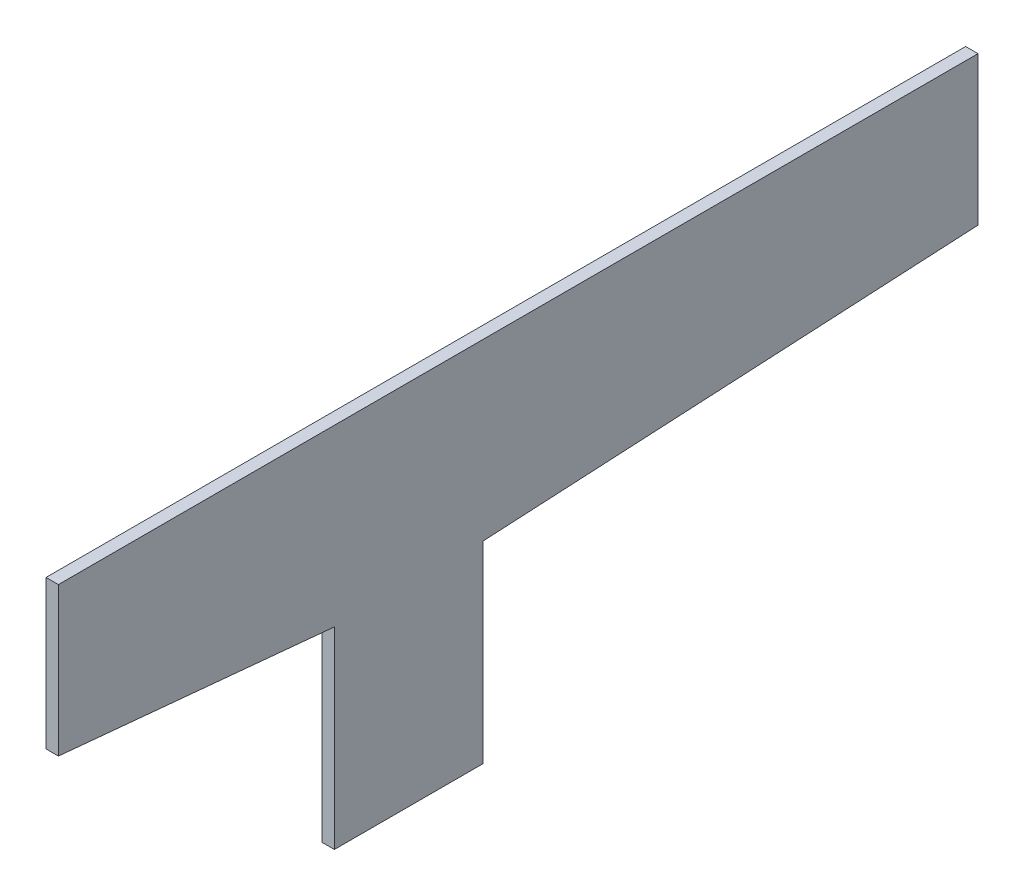
ISO-10303-21;
HEADER;
FILE_DESCRIPTION(('STEP AP214'),'2;1');
FILE_NAME('part.step','',(''),(''),'','','');
FILE_SCHEMA(('AUTOMOTIVE_DESIGN { 1 0 10303 214 1 1 1 1 }'));
ENDSEC;
DATA;
#1=APPLICATION_CONTEXT('core data for automotive mechanical design processes');
#2=APPLICATION_PROTOCOL_DEFINITION('international standard','automotive_design',2000,#1);
#3=PRODUCT_CONTEXT('',#1,'mechanical');
#4=PRODUCT('Part','Part','',(#3));
#5=PRODUCT_RELATED_PRODUCT_CATEGORY('part','',(#4));
#6=PRODUCT_DEFINITION_FORMATION('','',#4);
#7=PRODUCT_DEFINITION_CONTEXT('part definition',#1,'design');
#8=PRODUCT_DEFINITION('design','',#6,#7);
#9=PRODUCT_DEFINITION_SHAPE('','',#8);
#10=(LENGTH_UNIT() NAMED_UNIT(*) SI_UNIT(.MILLI.,.METRE.));
#11=(NAMED_UNIT(*) PLANE_ANGLE_UNIT() SI_UNIT($,.RADIAN.));
#12=(NAMED_UNIT(*) SI_UNIT($,.STERADIAN.) SOLID_ANGLE_UNIT());
#13=UNCERTAINTY_MEASURE_WITH_UNIT(LENGTH_MEASURE(1.E-05),#10,'distance_accuracy_value','');
#14=(GEOMETRIC_REPRESENTATION_CONTEXT(3) GLOBAL_UNCERTAINTY_ASSIGNED_CONTEXT((#13)) GLOBAL_UNIT_ASSIGNED_CONTEXT((#10,
#11,#12)) REPRESENTATION_CONTEXT('',''));
#15=CARTESIAN_POINT('',(0.,0.,0.));
#16=DIRECTION('',(0.,0.,1.));
#17=DIRECTION('',(1.,0.,0.));
#18=AXIS2_PLACEMENT_3D('',#15,#16,#17);
#19=CARTESIAN_POINT('',(1.5875,18.0500000008994,89.85));
#20=DIRECTION('',(0.,0.995552171318607,-0.0942118579734322));
#21=DIRECTION('',(0.,0.0942118579734322,0.995552171318608));
#22=AXIS2_PLACEMENT_3D('',#19,#20,#21);
#23=PLANE('',#22);
#24=DIRECTION('',(0.,-0.0942118579734322,-0.995552171318608));
#25=VECTOR('',#24,1.);
#26=CARTESIAN_POINT('',(-1.5875,18.0500000008994,89.85));
#27=LINE('',#26,#25);
#28=CARTESIAN_POINT('',(-1.5875,18.0500000008994,89.85));
#29=VERTEX_POINT('',#28);
#30=CARTESIAN_POINT('',(-1.5875,11.3500000042299,19.05));
#31=VERTEX_POINT('',#30);
#32=EDGE_CURVE('E129',#29,#31,#27,.T.);
#33=ORIENTED_EDGE('',*,*,#32,.T.);
#34=DIRECTION('',(-1.,0.,0.));
#35=VECTOR('',#34,1.);
#36=CARTESIAN_POINT('',(1.5875,11.3500000042299,19.05));
#37=LINE('',#36,#35);
#38=CARTESIAN_POINT('',(1.5875,11.3500000042299,19.05));
#39=VERTEX_POINT('',#38);
#40=EDGE_CURVE('E11',#39,#31,#37,.T.);
#41=ORIENTED_EDGE('',*,*,#40,.F.);
#42=DIRECTION('',(0.,-0.0942118579734322,-0.995552171318608));
#43=VECTOR('',#42,1.);
#44=CARTESIAN_POINT('',(1.5875,18.0500000008994,89.85));
#45=LINE('',#44,#43);
#46=CARTESIAN_POINT('',(1.5875,18.0500000008994,89.85));
#47=VERTEX_POINT('',#46);
#48=EDGE_CURVE('E143',#47,#39,#45,.T.);
#49=ORIENTED_EDGE('',*,*,#48,.F.);
#50=DIRECTION('',(-1.,0.,0.));
#51=VECTOR('',#50,1.);
#52=CARTESIAN_POINT('',(1.5875,18.0500000008994,89.85));
#53=LINE('',#52,#51);
#54=EDGE_CURVE('E125',#47,#29,#53,.T.);
#55=ORIENTED_EDGE('',*,*,#54,.T.);
#56=EDGE_LOOP('',(#33,#41,#49,#55));
#57=FACE_BOUND('',#56,.T.);
#58=ADVANCED_FACE('F33',(#57),#23,.F.);
#59=CARTESIAN_POINT('',(1.5875,11.3500000042299,19.05));
#60=DIRECTION('',(0.,0.,-1.));
#61=DIRECTION('',(-1.,0.,0.));
#62=AXIS2_PLACEMENT_3D('',#59,#60,#61);
#63=PLANE('',#62);
#64=DIRECTION('',(0.,-1.,0.));
#65=VECTOR('',#64,1.);
#66=CARTESIAN_POINT('',(-1.5875,11.3500000042299,19.05));
#67=LINE('',#66,#65);
#68=CARTESIAN_POINT('',(-1.5875,-38.1,19.05));
#69=VERTEX_POINT('',#68);
#70=EDGE_CURVE('E132',#31,#69,#67,.T.);
#71=ORIENTED_EDGE('',*,*,#70,.T.);
#72=DIRECTION('',(-1.,0.,0.));
#73=VECTOR('',#72,1.);
#74=CARTESIAN_POINT('',(1.5875,-38.1,19.05));
#75=LINE('',#74,#73);
#76=CARTESIAN_POINT('',(1.5875,-38.1,19.05));
#77=VERTEX_POINT('',#76);
#78=EDGE_CURVE('E41',#77,#69,#75,.T.);
#79=ORIENTED_EDGE('',*,*,#78,.F.);
#80=DIRECTION('',(0.,-1.,0.));
#81=VECTOR('',#80,1.);
#82=CARTESIAN_POINT('',(1.5875,11.3500000042299,19.05));
#83=LINE('',#82,#81);
#84=EDGE_CURVE('E92',#39,#77,#83,.T.);
#85=ORIENTED_EDGE('',*,*,#84,.F.);
#86=ORIENTED_EDGE('',*,*,#40,.T.);
#87=EDGE_LOOP('',(#71,#79,#85,#86));
#88=FACE_BOUND('',#87,.T.);
#89=ADVANCED_FACE('F178',(#88),#63,.F.);
#90=CARTESIAN_POINT('',(1.5875,-38.1,19.05));
#91=DIRECTION('',(0.,1.,0.));
#92=DIRECTION('',(0.,0.,1.));
#93=AXIS2_PLACEMENT_3D('',#90,#91,#92);
#94=PLANE('',#93);
#95=DIRECTION('',(0.,0.,-1.));
#96=VECTOR('',#95,1.);
#97=CARTESIAN_POINT('',(-1.5875,-38.1,19.05));
#98=LINE('',#97,#96);
#99=CARTESIAN_POINT('',(-1.5875,-38.1,-19.05));
#100=VERTEX_POINT('',#99);
#101=EDGE_CURVE('E134',#69,#100,#98,.T.);
#102=ORIENTED_EDGE('',*,*,#101,.T.);
#103=DIRECTION('',(-1.,0.,0.));
#104=VECTOR('',#103,1.);
#105=CARTESIAN_POINT('',(1.5875,-38.1,-19.05));
#106=LINE('',#105,#104);
#107=CARTESIAN_POINT('',(1.5875,-38.1,-19.05));
#108=VERTEX_POINT('',#107);
#109=EDGE_CURVE('E150',#108,#100,#106,.T.);
#110=ORIENTED_EDGE('',*,*,#109,.F.);
#111=DIRECTION('',(0.,0.,-1.));
#112=VECTOR('',#111,1.);
#113=CARTESIAN_POINT('',(1.5875,-38.1,19.05));
#114=LINE('',#113,#112);
#115=EDGE_CURVE('E158',#77,#108,#114,.T.);
#116=ORIENTED_EDGE('',*,*,#115,.F.);
#117=ORIENTED_EDGE('',*,*,#78,.T.);
#118=EDGE_LOOP('',(#102,#110,#116,#117));
#119=FACE_BOUND('',#118,.T.);
#120=ADVANCED_FACE('F156',(#119),#94,.F.);
#121=CARTESIAN_POINT('',(1.5875,-38.1,-19.05));
#122=DIRECTION('',(0.,0.,1.));
#123=DIRECTION('',(1.,0.,0.));
#124=AXIS2_PLACEMENT_3D('',#121,#122,#123);
#125=PLANE('',#124);
#126=DIRECTION('',(0.,1.,0.));
#127=VECTOR('',#126,1.);
#128=CARTESIAN_POINT('',(-1.5875,-38.1,-19.05));
#129=LINE('',#128,#127);
#130=CARTESIAN_POINT('',(-1.5875,11.3500000042299,-19.05));
#131=VERTEX_POINT('',#130);
#132=EDGE_CURVE('E136',#100,#131,#129,.T.);
#133=ORIENTED_EDGE('',*,*,#132,.T.);
#134=DIRECTION('',(-1.,0.,0.));
#135=VECTOR('',#134,1.);
#136=CARTESIAN_POINT('',(1.5875,11.3500000042299,-19.05));
#137=LINE('',#136,#135);
#138=CARTESIAN_POINT('',(1.5875,11.3500000042299,-19.05));
#139=VERTEX_POINT('',#138);
#140=EDGE_CURVE('E147',#139,#131,#137,.T.);
#141=ORIENTED_EDGE('',*,*,#140,.F.);
#142=DIRECTION('',(0.,1.,0.));
#143=VECTOR('',#142,1.);
#144=CARTESIAN_POINT('',(1.5875,-38.1,-19.05));
#145=LINE('',#144,#143);
#146=EDGE_CURVE('E170',#108,#139,#145,.T.);
#147=ORIENTED_EDGE('',*,*,#146,.F.);
#148=ORIENTED_EDGE('',*,*,#109,.T.);
#149=EDGE_LOOP('',(#133,#141,#147,#148));
#150=FACE_BOUND('',#149,.T.);
#151=ADVANCED_FACE('F166',(#150),#125,.F.);
#152=CARTESIAN_POINT('',(1.5875,11.3500000042299,-19.05));
#153=DIRECTION('',(0.,0.998611305293115,0.0526826436388818));
#154=DIRECTION('',(0.,-0.0526826436388818,0.998611305293115));
#155=AXIS2_PLACEMENT_3D('',#152,#153,#154);
#156=PLANE('',#155);
#157=DIRECTION('',(0.,0.0526826436388818,-0.998611305293115));
#158=VECTOR('',#157,1.);
#159=CARTESIAN_POINT('',(-1.5875,11.3500000042299,-19.05));
#160=LINE('',#159,#158);
#161=CARTESIAN_POINT('',(-1.5875,18.0500000008994,-146.05));
#162=VERTEX_POINT('',#161);
#163=EDGE_CURVE('E138',#131,#162,#160,.T.);
#164=ORIENTED_EDGE('',*,*,#163,.T.);
#165=DIRECTION('',(-1.,0.,0.));
#166=VECTOR('',#165,1.);
#167=CARTESIAN_POINT('',(1.5875,18.0500000008994,-146.05));
#168=LINE('',#167,#166);
#169=CARTESIAN_POINT('',(1.5875,18.0500000008994,-146.05));
#170=VERTEX_POINT('',#169);
#171=EDGE_CURVE('E120',#170,#162,#168,.T.);
#172=ORIENTED_EDGE('',*,*,#171,.F.);
#173=DIRECTION('',(0.,0.0526826436388818,-0.998611305293115));
#174=VECTOR('',#173,1.);
#175=CARTESIAN_POINT('',(1.5875,11.3500000042299,-19.05));
#176=LINE('',#175,#174);
#177=EDGE_CURVE('E111',#139,#170,#176,.T.);
#178=ORIENTED_EDGE('',*,*,#177,.F.);
#179=ORIENTED_EDGE('',*,*,#140,.T.);
#180=EDGE_LOOP('',(#164,#172,#178,#179));
#181=FACE_BOUND('',#180,.T.);
#182=ADVANCED_FACE('F169',(#181),#156,.F.);
#183=CARTESIAN_POINT('',(1.5875,18.0500000008994,-146.05));
#184=DIRECTION('',(0.,0.,1.));
#185=DIRECTION('',(1.,0.,0.));
#186=AXIS2_PLACEMENT_3D('',#183,#184,#185);
#187=PLANE('',#186);
#188=DIRECTION('',(0.,1.,0.));
#189=VECTOR('',#188,1.);
#190=CARTESIAN_POINT('',(-1.5875,18.0500000008994,-146.05));
#191=LINE('',#190,#189);
#192=CARTESIAN_POINT('',(-1.5875,56.1500000008994,-146.05));
#193=VERTEX_POINT('',#192);
#194=EDGE_CURVE('E119',#162,#193,#191,.T.);
#195=ORIENTED_EDGE('',*,*,#194,.T.);
#196=DIRECTION('',(-1.,0.,0.));
#197=VECTOR('',#196,1.);
#198=CARTESIAN_POINT('',(1.5875,56.1500000008994,-146.05));
#199=LINE('',#198,#197);
#200=CARTESIAN_POINT('',(1.5875,56.1500000008994,-146.05));
#201=VERTEX_POINT('',#200);
#202=EDGE_CURVE('E116',#201,#193,#199,.T.);
#203=ORIENTED_EDGE('',*,*,#202,.F.);
#204=DIRECTION('',(0.,1.,0.));
#205=VECTOR('',#204,1.);
#206=CARTESIAN_POINT('',(1.5875,18.0500000008994,-146.05));
#207=LINE('',#206,#205);
#208=EDGE_CURVE('E105',#170,#201,#207,.T.);
#209=ORIENTED_EDGE('',*,*,#208,.F.);
#210=ORIENTED_EDGE('',*,*,#171,.T.);
#211=EDGE_LOOP('',(#195,#203,#209,#210));
#212=FACE_BOUND('',#211,.T.);
#213=ADVANCED_FACE('F117',(#212),#187,.F.);
#214=CARTESIAN_POINT('',(1.5875,56.1500000008994,-146.05));
#215=DIRECTION('',(0.,-1.,0.));
#216=DIRECTION('',(0.,0.,-1.));
#217=AXIS2_PLACEMENT_3D('',#214,#215,#216);
#218=PLANE('',#217);
#219=DIRECTION('',(0.,0.,1.));
#220=VECTOR('',#219,1.);
#221=CARTESIAN_POINT('',(-1.5875,56.1500000008994,-146.05));
#222=LINE('',#221,#220);
#223=CARTESIAN_POINT('',(-1.5875,56.1500000008994,89.85));
#224=VERTEX_POINT('',#223);
#225=EDGE_CURVE('E78',#193,#224,#222,.T.);
#226=ORIENTED_EDGE('',*,*,#225,.T.);
#227=DIRECTION('',(-1.,0.,0.));
#228=VECTOR('',#227,1.);
#229=CARTESIAN_POINT('',(1.5875,56.1500000008994,89.85));
#230=LINE('',#229,#228);
#231=CARTESIAN_POINT('',(1.5875,56.1500000008994,89.85));
#232=VERTEX_POINT('',#231);
#233=EDGE_CURVE('E121',#232,#224,#230,.T.);
#234=ORIENTED_EDGE('',*,*,#233,.F.);
#235=DIRECTION('',(0.,0.,1.));
#236=VECTOR('',#235,1.);
#237=CARTESIAN_POINT('',(1.5875,56.1500000008994,-146.05));
#238=LINE('',#237,#236);
#239=EDGE_CURVE('E109',#201,#232,#238,.T.);
#240=ORIENTED_EDGE('',*,*,#239,.F.);
#241=ORIENTED_EDGE('',*,*,#202,.T.);
#242=EDGE_LOOP('',(#226,#234,#240,#241));
#243=FACE_BOUND('',#242,.T.);
#244=ADVANCED_FACE('F123',(#243),#218,.F.);
#245=CARTESIAN_POINT('',(1.5875,56.1500000008994,89.85));
#246=DIRECTION('',(0.,0.,-1.));
#247=DIRECTION('',(0.,1.,0.));
#248=AXIS2_PLACEMENT_3D('',#245,#246,#247);
#249=PLANE('',#248);
#250=DIRECTION('',(0.,-1.,0.));
#251=VECTOR('',#250,1.);
#252=CARTESIAN_POINT('',(-1.5875,56.1500000008994,89.85));
#253=LINE('',#252,#251);
#254=EDGE_CURVE('E84',#224,#29,#253,.T.);
#255=ORIENTED_EDGE('',*,*,#254,.T.);
#256=ORIENTED_EDGE('',*,*,#54,.F.);
#257=DIRECTION('',(0.,-1.,0.));
#258=VECTOR('',#257,1.);
#259=CARTESIAN_POINT('',(1.5875,56.1500000008994,89.85));
#260=LINE('',#259,#258);
#261=EDGE_CURVE('E49',#232,#47,#260,.T.);
#262=ORIENTED_EDGE('',*,*,#261,.F.);
#263=ORIENTED_EDGE('',*,*,#233,.T.);
#264=EDGE_LOOP('',(#255,#256,#262,#263));
#265=FACE_BOUND('',#264,.T.);
#266=ADVANCED_FACE('F194',(#265),#249,.F.);
#267=CARTESIAN_POINT('',(1.5875,0.,0.));
#268=DIRECTION('',(-1.,0.,0.));
#269=DIRECTION('',(0.,0.,1.));
#270=AXIS2_PLACEMENT_3D('',#267,#268,#269);
#271=PLANE('',#270);
#272=ORIENTED_EDGE('',*,*,#48,.T.);
#273=ORIENTED_EDGE('',*,*,#84,.T.);
#274=ORIENTED_EDGE('',*,*,#115,.T.);
#275=ORIENTED_EDGE('',*,*,#146,.T.);
#276=ORIENTED_EDGE('',*,*,#177,.T.);
#277=ORIENTED_EDGE('',*,*,#208,.T.);
#278=ORIENTED_EDGE('',*,*,#239,.T.);
#279=ORIENTED_EDGE('',*,*,#261,.T.);
#280=EDGE_LOOP('',(#272,#273,#274,#275,#276,#277,#278,#279));
#281=FACE_BOUND('',#280,.T.);
#282=ADVANCED_FACE('F107',(#281),#271,.F.);
#283=CARTESIAN_POINT('',(-1.5875,0.,0.));
#284=DIRECTION('',(-1.,0.,0.));
#285=DIRECTION('',(0.,0.,1.));
#286=AXIS2_PLACEMENT_3D('',#283,#284,#285);
#287=PLANE('',#286);
#288=ORIENTED_EDGE('',*,*,#32,.F.);
#289=ORIENTED_EDGE('',*,*,#254,.F.);
#290=ORIENTED_EDGE('',*,*,#225,.F.);
#291=ORIENTED_EDGE('',*,*,#194,.F.);
#292=ORIENTED_EDGE('',*,*,#163,.F.);
#293=ORIENTED_EDGE('',*,*,#132,.F.);
#294=ORIENTED_EDGE('',*,*,#101,.F.);
#295=ORIENTED_EDGE('',*,*,#70,.F.);
#296=EDGE_LOOP('',(#288,#289,#290,#291,#292,#293,#294,#295));
#297=FACE_BOUND('',#296,.T.);
#298=ADVANCED_FACE('F162',(#297),#287,.T.);
#299=CLOSED_SHELL('',(#58,#89,#120,#151,#182,#213,#244,#266,#282,#298));
#300=MANIFOLD_SOLID_BREP('B2',#299);
#301=ADVANCED_BREP_SHAPE_REPRESENTATION('',(#18,#300),#14);
#302=SHAPE_DEFINITION_REPRESENTATION(#9,#301);
ENDSEC;
END-ISO-10303-21;
